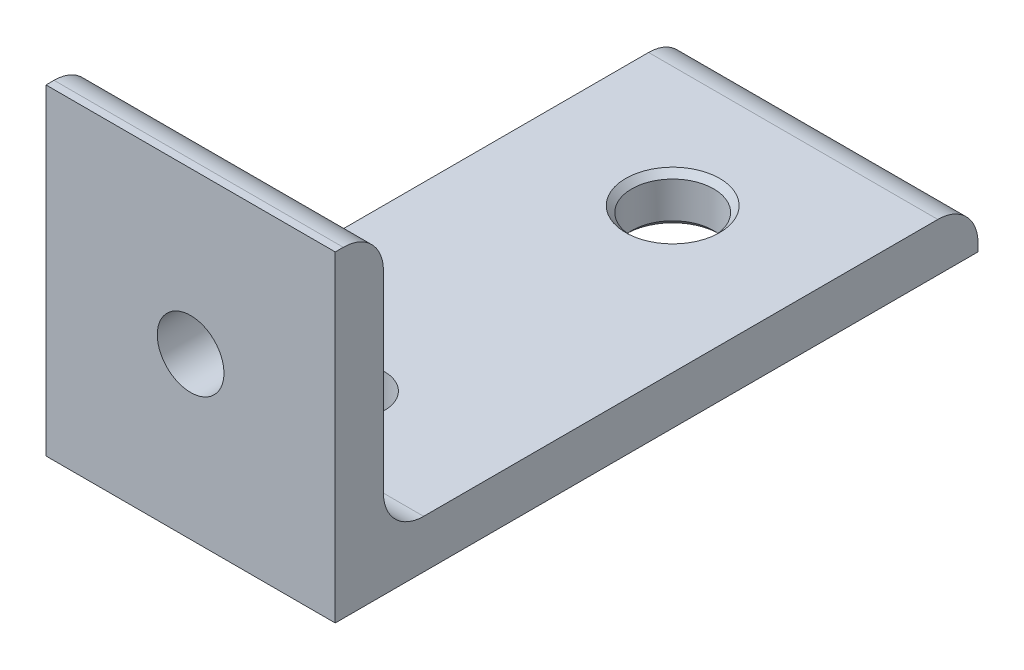
ISO-10303-21;
HEADER;
FILE_DESCRIPTION(('STEP AP214'),'2;1');
FILE_NAME('part.step','',(''),(''),'','','');
FILE_SCHEMA(('AUTOMOTIVE_DESIGN { 1 0 10303 214 1 1 1 1 }'));
ENDSEC;
DATA;
#1=APPLICATION_CONTEXT('core data for automotive mechanical design processes');
#2=APPLICATION_PROTOCOL_DEFINITION('international standard','automotive_design',2000,#1);
#3=PRODUCT_CONTEXT('',#1,'mechanical');
#4=PRODUCT('Part','Part','',(#3));
#5=PRODUCT_RELATED_PRODUCT_CATEGORY('part','',(#4));
#6=PRODUCT_DEFINITION_FORMATION('','',#4);
#7=PRODUCT_DEFINITION_CONTEXT('part definition',#1,'design');
#8=PRODUCT_DEFINITION('design','',#6,#7);
#9=PRODUCT_DEFINITION_SHAPE('','',#8);
#10=(LENGTH_UNIT() NAMED_UNIT(*) SI_UNIT(.MILLI.,.METRE.));
#11=(NAMED_UNIT(*) PLANE_ANGLE_UNIT() SI_UNIT($,.RADIAN.));
#12=(NAMED_UNIT(*) SI_UNIT($,.STERADIAN.) SOLID_ANGLE_UNIT());
#13=UNCERTAINTY_MEASURE_WITH_UNIT(LENGTH_MEASURE(1.E-05),#10,'distance_accuracy_value','');
#14=(GEOMETRIC_REPRESENTATION_CONTEXT(3) GLOBAL_UNCERTAINTY_ASSIGNED_CONTEXT((#13)) GLOBAL_UNIT_ASSIGNED_CONTEXT((#10,
#11,#12)) REPRESENTATION_CONTEXT('',''));
#15=CARTESIAN_POINT('',(0.,0.,0.));
#16=DIRECTION('',(0.,0.,1.));
#17=DIRECTION('',(1.,0.,0.));
#18=AXIS2_PLACEMENT_3D('',#15,#16,#17);
#19=CARTESIAN_POINT('',(18.,40.,0.));
#20=DIRECTION('',(0.,-1.,0.));
#21=DIRECTION('',(0.,0.,-1.));
#22=AXIS2_PLACEMENT_3D('',#19,#20,#21);
#23=PLANE('',#22);
#24=DIRECTION('',(0.,0.,1.));
#25=VECTOR('',#24,1.);
#26=CARTESIAN_POINT('',(18.,40.,0.));
#27=LINE('',#26,#25);
#28=CARTESIAN_POINT('',(18.,40.,-1.));
#29=VERTEX_POINT('',#28);
#30=CARTESIAN_POINT('',(18.,40.,0.));
#31=VERTEX_POINT('',#30);
#32=EDGE_CURVE('E111',#29,#31,#27,.T.);
#33=ORIENTED_EDGE('',*,*,#32,.F.);
#34=DIRECTION('',(-1.,0.,0.));
#35=VECTOR('',#34,1.);
#36=CARTESIAN_POINT('',(18.,40.,-1.));
#37=LINE('',#36,#35);
#38=CARTESIAN_POINT('',(-18.,40.,-1.));
#39=VERTEX_POINT('',#38);
#40=EDGE_CURVE('E152',#29,#39,#37,.T.);
#41=ORIENTED_EDGE('',*,*,#40,.T.);
#42=DIRECTION('',(0.,0.,1.));
#43=VECTOR('',#42,1.);
#44=CARTESIAN_POINT('',(-18.,40.,0.));
#45=LINE('',#44,#43);
#46=CARTESIAN_POINT('',(-18.,40.,0.));
#47=VERTEX_POINT('',#46);
#48=EDGE_CURVE('E135',#39,#47,#45,.T.);
#49=ORIENTED_EDGE('',*,*,#48,.T.);
#50=DIRECTION('',(-1.,0.,0.));
#51=VECTOR('',#50,1.);
#52=CARTESIAN_POINT('',(18.,40.,0.));
#53=LINE('',#52,#51);
#54=EDGE_CURVE('E128',#31,#47,#53,.T.);
#55=ORIENTED_EDGE('',*,*,#54,.F.);
#56=EDGE_LOOP('',(#33,#41,#49,#55));
#57=FACE_BOUND('',#56,.T.);
#58=ADVANCED_FACE('F39',(#57),#23,.F.);
#59=CARTESIAN_POINT('',(18.,40.,0.));
#60=DIRECTION('',(0.,0.,-1.));
#61=DIRECTION('',(-1.,0.,0.));
#62=AXIS2_PLACEMENT_3D('',#59,#60,#61);
#63=PLANE('',#62);
#64=CARTESIAN_POINT('',(0.,20.,0.));
#65=DIRECTION('',(0.,0.,-1.));
#66=DIRECTION('',(-1.,0.,0.));
#67=AXIS2_PLACEMENT_3D('',#64,#65,#66);
#68=CIRCLE('',#67,4.15);
#69=CARTESIAN_POINT('',(-4.15,20.,0.));
#70=VERTEX_POINT('',#69);
#71=EDGE_CURVE('E227',#70,#70,#68,.T.);
#72=ORIENTED_EDGE('',*,*,#71,.T.);
#73=EDGE_LOOP('',(#72));
#74=FACE_BOUND('',#73,.T.);
#75=DIRECTION('',(0.,-1.,0.));
#76=VECTOR('',#75,1.);
#77=CARTESIAN_POINT('',(-18.,40.,0.));
#78=LINE('',#77,#76);
#79=CARTESIAN_POINT('',(-18.,0.,0.));
#80=VERTEX_POINT('',#79);
#81=EDGE_CURVE('E196',#47,#80,#78,.T.);
#82=ORIENTED_EDGE('',*,*,#81,.T.);
#83=DIRECTION('',(-1.,0.,0.));
#84=VECTOR('',#83,1.);
#85=CARTESIAN_POINT('',(18.,0.,0.));
#86=LINE('',#85,#84);
#87=CARTESIAN_POINT('',(18.,0.,0.));
#88=VERTEX_POINT('',#87);
#89=EDGE_CURVE('E130',#88,#80,#86,.T.);
#90=ORIENTED_EDGE('',*,*,#89,.F.);
#91=DIRECTION('',(0.,-1.,0.));
#92=VECTOR('',#91,1.);
#93=CARTESIAN_POINT('',(18.,40.,0.));
#94=LINE('',#93,#92);
#95=EDGE_CURVE('E115',#31,#88,#94,.T.);
#96=ORIENTED_EDGE('',*,*,#95,.F.);
#97=ORIENTED_EDGE('',*,*,#54,.T.);
#98=EDGE_LOOP('',(#82,#90,#96,#97));
#99=FACE_BOUND('',#98,.T.);
#100=ADVANCED_FACE('F127',(#74,#99),#63,.F.);
#101=CARTESIAN_POINT('',(18.,0.,0.));
#102=DIRECTION('',(0.,1.,0.));
#103=DIRECTION('',(0.,0.,1.));
#104=AXIS2_PLACEMENT_3D('',#101,#102,#103);
#105=PLANE('',#104);
#106=CARTESIAN_POINT('',(0.,0.,-60.));
#107=DIRECTION('',(0.,1.,0.));
#108=DIRECTION('',(0.,0.,1.));
#109=AXIS2_PLACEMENT_3D('',#106,#107,#108);
#110=CIRCLE('',#109,5.85);
#111=CARTESIAN_POINT('',(0.,0.,-54.15));
#112=VERTEX_POINT('',#111);
#113=EDGE_CURVE('E165',#112,#112,#110,.T.);
#114=ORIENTED_EDGE('',*,*,#113,.T.);
#115=EDGE_LOOP('',(#114));
#116=FACE_BOUND('',#115,.T.);
#117=CARTESIAN_POINT('',(0.,0.,-20.));
#118=DIRECTION('',(0.,1.,0.));
#119=DIRECTION('',(0.,0.,1.));
#120=AXIS2_PLACEMENT_3D('',#117,#118,#119);
#121=CIRCLE('',#120,4.15);
#122=CARTESIAN_POINT('',(0.,0.,-15.85));
#123=VERTEX_POINT('',#122);
#124=EDGE_CURVE('E190',#123,#123,#121,.T.);
#125=ORIENTED_EDGE('',*,*,#124,.T.);
#126=EDGE_LOOP('',(#125));
#127=FACE_BOUND('',#126,.T.);
#128=DIRECTION('',(0.,0.,-1.));
#129=VECTOR('',#128,1.);
#130=CARTESIAN_POINT('',(-18.,0.,0.));
#131=LINE('',#130,#129);
#132=CARTESIAN_POINT('',(-18.,0.,-80.));
#133=VERTEX_POINT('',#132);
#134=EDGE_CURVE('E193',#80,#133,#131,.T.);
#135=ORIENTED_EDGE('',*,*,#134,.T.);
#136=DIRECTION('',(-1.,0.,0.));
#137=VECTOR('',#136,1.);
#138=CARTESIAN_POINT('',(18.,0.,-80.));
#139=LINE('',#138,#137);
#140=CARTESIAN_POINT('',(18.,0.,-80.));
#141=VERTEX_POINT('',#140);
#142=EDGE_CURVE('E141',#141,#133,#139,.T.);
#143=ORIENTED_EDGE('',*,*,#142,.F.);
#144=DIRECTION('',(0.,0.,-1.));
#145=VECTOR('',#144,1.);
#146=CARTESIAN_POINT('',(18.,0.,0.));
#147=LINE('',#146,#145);
#148=EDGE_CURVE('E132',#88,#141,#147,.T.);
#149=ORIENTED_EDGE('',*,*,#148,.F.);
#150=ORIENTED_EDGE('',*,*,#89,.T.);
#151=EDGE_LOOP('',(#135,#143,#149,#150));
#152=FACE_BOUND('',#151,.T.);
#153=ADVANCED_FACE('F182',(#116,#127,#152),#105,.F.);
#154=CARTESIAN_POINT('',(18.,6.,-80.));
#155=DIRECTION('',(0.,0.,1.));
#156=DIRECTION('',(1.,0.,0.));
#157=AXIS2_PLACEMENT_3D('',#154,#155,#156);
#158=PLANE('',#157);
#159=DIRECTION('',(0.,1.,0.));
#160=VECTOR('',#159,1.);
#161=CARTESIAN_POINT('',(-18.,6.,-80.));
#162=LINE('',#161,#160);
#163=CARTESIAN_POINT('',(-18.,1.,-80.));
#164=VERTEX_POINT('',#163);
#165=EDGE_CURVE('E195',#133,#164,#162,.T.);
#166=ORIENTED_EDGE('',*,*,#165,.T.);
#167=DIRECTION('',(-1.,0.,0.));
#168=VECTOR('',#167,1.);
#169=CARTESIAN_POINT('',(18.,1.,-80.));
#170=LINE('',#169,#168);
#171=CARTESIAN_POINT('',(18.,1.,-80.));
#172=VERTEX_POINT('',#171);
#173=EDGE_CURVE('E54',#164,#172,#170,.F.);
#174=ORIENTED_EDGE('',*,*,#173,.T.);
#175=DIRECTION('',(0.,1.,0.));
#176=VECTOR('',#175,1.);
#177=CARTESIAN_POINT('',(18.,6.,-80.));
#178=LINE('',#177,#176);
#179=EDGE_CURVE('E198',#141,#172,#178,.T.);
#180=ORIENTED_EDGE('',*,*,#179,.F.);
#181=ORIENTED_EDGE('',*,*,#142,.T.);
#182=EDGE_LOOP('',(#166,#174,#180,#181));
#183=FACE_BOUND('',#182,.T.);
#184=ADVANCED_FACE('F185',(#183),#158,.F.);
#185=CARTESIAN_POINT('',(18.,6.,-6.));
#186=DIRECTION('',(0.,-1.,0.));
#187=DIRECTION('',(0.,0.,-1.));
#188=AXIS2_PLACEMENT_3D('',#185,#186,#187);
#189=PLANE('',#188);
#190=CARTESIAN_POINT('',(0.,6.,-60.));
#191=DIRECTION('',(0.,-1.,0.));
#192=DIRECTION('',(0.,0.,-1.));
#193=AXIS2_PLACEMENT_3D('',#190,#191,#192);
#194=CIRCLE('',#193,5.85000000000001);
#195=CARTESIAN_POINT('',(0.,6.,-65.85));
#196=VERTEX_POINT('',#195);
#197=EDGE_CURVE('E11',#196,#196,#194,.T.);
#198=ORIENTED_EDGE('',*,*,#197,.T.);
#199=EDGE_LOOP('',(#198));
#200=FACE_BOUND('',#199,.T.);
#201=CARTESIAN_POINT('',(0.,6.,-20.));
#202=DIRECTION('',(0.,1.,0.));
#203=DIRECTION('',(0.,0.,1.));
#204=AXIS2_PLACEMENT_3D('',#201,#202,#203);
#205=CIRCLE('',#204,4.15);
#206=CARTESIAN_POINT('',(0.,6.,-15.85));
#207=VERTEX_POINT('',#206);
#208=EDGE_CURVE('E216',#207,#207,#205,.T.);
#209=ORIENTED_EDGE('',*,*,#208,.F.);
#210=EDGE_LOOP('',(#209));
#211=FACE_BOUND('',#210,.T.);
#212=DIRECTION('',(0.,0.,1.));
#213=VECTOR('',#212,1.);
#214=CARTESIAN_POINT('',(-18.,6.,-6.));
#215=LINE('',#214,#213);
#216=CARTESIAN_POINT('',(-18.,6.,-75.));
#217=VERTEX_POINT('',#216);
#218=CARTESIAN_POINT('',(-18.,6.,-11.));
#219=VERTEX_POINT('',#218);
#220=EDGE_CURVE('E201',#217,#219,#215,.T.);
#221=ORIENTED_EDGE('',*,*,#220,.T.);
#222=DIRECTION('',(-1.,0.,0.));
#223=VECTOR('',#222,1.);
#224=CARTESIAN_POINT('',(18.,6.,-11.));
#225=LINE('',#224,#223);
#226=CARTESIAN_POINT('',(18.,6.,-11.));
#227=VERTEX_POINT('',#226);
#228=EDGE_CURVE('E150',#219,#227,#225,.F.);
#229=ORIENTED_EDGE('',*,*,#228,.T.);
#230=DIRECTION('',(0.,0.,1.));
#231=VECTOR('',#230,1.);
#232=CARTESIAN_POINT('',(18.,6.,-6.));
#233=LINE('',#232,#231);
#234=CARTESIAN_POINT('',(18.,6.,-75.));
#235=VERTEX_POINT('',#234);
#236=EDGE_CURVE('E222',#235,#227,#233,.T.);
#237=ORIENTED_EDGE('',*,*,#236,.F.);
#238=DIRECTION('',(-1.,0.,0.));
#239=VECTOR('',#238,1.);
#240=CARTESIAN_POINT('',(18.,6.,-75.));
#241=LINE('',#240,#239);
#242=EDGE_CURVE('E147',#235,#217,#241,.T.);
#243=ORIENTED_EDGE('',*,*,#242,.T.);
#244=EDGE_LOOP('',(#221,#229,#237,#243));
#245=FACE_BOUND('',#244,.T.);
#246=ADVANCED_FACE('F244',(#200,#211,#245),#189,.F.);
#247=CARTESIAN_POINT('',(18.,40.,-6.));
#248=DIRECTION('',(0.,0.,1.));
#249=DIRECTION('',(1.,0.,0.));
#250=AXIS2_PLACEMENT_3D('',#247,#248,#249);
#251=PLANE('',#250);
#252=CARTESIAN_POINT('',(0.,20.,-6.));
#253=DIRECTION('',(0.,0.,-1.));
#254=DIRECTION('',(-1.,0.,0.));
#255=AXIS2_PLACEMENT_3D('',#252,#253,#254);
#256=CIRCLE('',#255,4.15);
#257=CARTESIAN_POINT('',(-4.15,20.,-6.));
#258=VERTEX_POINT('',#257);
#259=EDGE_CURVE('E229',#258,#258,#256,.T.);
#260=ORIENTED_EDGE('',*,*,#259,.F.);
#261=EDGE_LOOP('',(#260));
#262=FACE_BOUND('',#261,.T.);
#263=DIRECTION('',(0.,1.,0.));
#264=VECTOR('',#263,1.);
#265=CARTESIAN_POINT('',(18.,40.,-6.));
#266=LINE('',#265,#264);
#267=CARTESIAN_POINT('',(18.,11.,-6.));
#268=VERTEX_POINT('',#267);
#269=CARTESIAN_POINT('',(18.,35.,-6.));
#270=VERTEX_POINT('',#269);
#271=EDGE_CURVE('E199',#268,#270,#266,.T.);
#272=ORIENTED_EDGE('',*,*,#271,.F.);
#273=DIRECTION('',(-1.,0.,0.));
#274=VECTOR('',#273,1.);
#275=CARTESIAN_POINT('',(-18.,11.,-6.));
#276=LINE('',#275,#274);
#277=CARTESIAN_POINT('',(-18.,11.,-6.));
#278=VERTEX_POINT('',#277);
#279=EDGE_CURVE('E139',#268,#278,#276,.T.);
#280=ORIENTED_EDGE('',*,*,#279,.T.);
#281=DIRECTION('',(0.,1.,0.));
#282=VECTOR('',#281,1.);
#283=CARTESIAN_POINT('',(-18.,40.,-6.));
#284=LINE('',#283,#282);
#285=CARTESIAN_POINT('',(-18.,35.,-6.));
#286=VERTEX_POINT('',#285);
#287=EDGE_CURVE('E123',#278,#286,#284,.T.);
#288=ORIENTED_EDGE('',*,*,#287,.T.);
#289=DIRECTION('',(-1.,0.,0.));
#290=VECTOR('',#289,1.);
#291=CARTESIAN_POINT('',(18.,35.,-6.));
#292=LINE('',#291,#290);
#293=EDGE_CURVE('E137',#286,#270,#292,.F.);
#294=ORIENTED_EDGE('',*,*,#293,.T.);
#295=EDGE_LOOP('',(#272,#280,#288,#294));
#296=FACE_BOUND('',#295,.T.);
#297=ADVANCED_FACE('F212',(#262,#296),#251,.F.);
#298=CARTESIAN_POINT('',(18.,0.,0.));
#299=DIRECTION('',(-1.,0.,0.));
#300=DIRECTION('',(0.,0.,1.));
#301=AXIS2_PLACEMENT_3D('',#298,#299,#300);
#302=PLANE('',#301);
#303=ORIENTED_EDGE('',*,*,#271,.T.);
#304=CARTESIAN_POINT('',(18.,35.,-1.));
#305=DIRECTION('',(-1.,0.,0.));
#306=DIRECTION('',(0.,0.,1.));
#307=AXIS2_PLACEMENT_3D('',#304,#305,#306);
#308=CIRCLE('',#307,5.);
#309=EDGE_CURVE('E118',#270,#29,#308,.F.);
#310=ORIENTED_EDGE('',*,*,#309,.T.);
#311=ORIENTED_EDGE('',*,*,#32,.T.);
#312=ORIENTED_EDGE('',*,*,#95,.T.);
#313=ORIENTED_EDGE('',*,*,#148,.T.);
#314=ORIENTED_EDGE('',*,*,#179,.T.);
#315=CARTESIAN_POINT('',(18.,1.,-75.));
#316=DIRECTION('',(-1.,0.,0.));
#317=DIRECTION('',(0.,0.,1.));
#318=AXIS2_PLACEMENT_3D('',#315,#316,#317);
#319=CIRCLE('',#318,5.);
#320=EDGE_CURVE('E157',#172,#235,#319,.F.);
#321=ORIENTED_EDGE('',*,*,#320,.T.);
#322=ORIENTED_EDGE('',*,*,#236,.T.);
#323=CARTESIAN_POINT('',(18.,11.,-11.));
#324=DIRECTION('',(-1.,0.,0.));
#325=DIRECTION('',(0.,0.,1.));
#326=AXIS2_PLACEMENT_3D('',#323,#324,#325);
#327=CIRCLE('',#326,5.);
#328=EDGE_CURVE('E163',#227,#268,#327,.T.);
#329=ORIENTED_EDGE('',*,*,#328,.T.);
#330=EDGE_LOOP('',(#303,#310,#311,#312,#313,#314,#321,#322,#329));
#331=FACE_BOUND('',#330,.T.);
#332=ADVANCED_FACE('F114',(#331),#302,.F.);
#333=CARTESIAN_POINT('',(-18.,0.,0.));
#334=DIRECTION('',(-1.,0.,0.));
#335=DIRECTION('',(0.,0.,1.));
#336=AXIS2_PLACEMENT_3D('',#333,#334,#335);
#337=PLANE('',#336);
#338=ORIENTED_EDGE('',*,*,#48,.F.);
#339=CARTESIAN_POINT('',(-18.,35.,-1.));
#340=DIRECTION('',(-1.,0.,0.));
#341=DIRECTION('',(0.,0.,1.));
#342=AXIS2_PLACEMENT_3D('',#339,#340,#341);
#343=CIRCLE('',#342,5.);
#344=EDGE_CURVE('E155',#39,#286,#343,.T.);
#345=ORIENTED_EDGE('',*,*,#344,.T.);
#346=ORIENTED_EDGE('',*,*,#287,.F.);
#347=CARTESIAN_POINT('',(-18.,11.,-11.));
#348=DIRECTION('',(-1.,0.,0.));
#349=DIRECTION('',(0.,0.,1.));
#350=AXIS2_PLACEMENT_3D('',#347,#348,#349);
#351=CIRCLE('',#350,5.);
#352=EDGE_CURVE('E161',#278,#219,#351,.F.);
#353=ORIENTED_EDGE('',*,*,#352,.T.);
#354=ORIENTED_EDGE('',*,*,#220,.F.);
#355=CARTESIAN_POINT('',(-18.,1.,-75.));
#356=DIRECTION('',(-1.,0.,0.));
#357=DIRECTION('',(0.,0.,1.));
#358=AXIS2_PLACEMENT_3D('',#355,#356,#357);
#359=CIRCLE('',#358,5.);
#360=EDGE_CURVE('E62',#217,#164,#359,.T.);
#361=ORIENTED_EDGE('',*,*,#360,.T.);
#362=ORIENTED_EDGE('',*,*,#165,.F.);
#363=ORIENTED_EDGE('',*,*,#134,.F.);
#364=ORIENTED_EDGE('',*,*,#81,.F.);
#365=EDGE_LOOP('',(#338,#345,#346,#353,#354,#361,#362,#363,#364));
#366=FACE_BOUND('',#365,.T.);
#367=ADVANCED_FACE('F200',(#366),#337,.T.);
#368=CARTESIAN_POINT('',(0.,0.,-20.));
#369=DIRECTION('',(0.,1.,0.));
#370=DIRECTION('',(0.,0.,1.));
#371=AXIS2_PLACEMENT_3D('',#368,#369,#370);
#372=CYLINDRICAL_SURFACE('',#371,4.15);
#373=ORIENTED_EDGE('',*,*,#124,.F.);
#374=EDGE_LOOP('',(#373));
#375=FACE_BOUND('',#374,.T.);
#376=ORIENTED_EDGE('',*,*,#208,.T.);
#377=EDGE_LOOP('',(#376));
#378=FACE_BOUND('',#377,.T.);
#379=ADVANCED_FACE('F295',(#375,#378),#372,.F.);
#380=CARTESIAN_POINT('',(0.,0.,-60.));
#381=DIRECTION('',(0.,1.,0.));
#382=DIRECTION('',(0.,0.,1.));
#383=AXIS2_PLACEMENT_3D('',#380,#381,#382);
#384=CYLINDRICAL_SURFACE('',#383,5.1);
#385=CARTESIAN_POINT('',(0.,0.75000000000001,-60.));
#386=DIRECTION('',(0.,1.,0.));
#387=DIRECTION('',(0.,0.,1.));
#388=AXIS2_PLACEMENT_3D('',#385,#386,#387);
#389=CIRCLE('',#388,5.1);
#390=CARTESIAN_POINT('',(0.,0.75000000000001,-54.9));
#391=VERTEX_POINT('',#390);
#392=EDGE_CURVE('E47',#391,#391,#389,.F.);
#393=ORIENTED_EDGE('',*,*,#392,.T.);
#394=EDGE_LOOP('',(#393));
#395=FACE_BOUND('',#394,.T.);
#396=CARTESIAN_POINT('',(0.,5.24999999999998,-60.));
#397=DIRECTION('',(0.,-1.,0.));
#398=DIRECTION('',(0.,0.,-1.));
#399=AXIS2_PLACEMENT_3D('',#396,#397,#398);
#400=CIRCLE('',#399,5.1);
#401=CARTESIAN_POINT('',(0.,5.24999999999998,-65.1));
#402=VERTEX_POINT('',#401);
#403=EDGE_CURVE('E168',#402,#402,#400,.F.);
#404=ORIENTED_EDGE('',*,*,#403,.T.);
#405=EDGE_LOOP('',(#404));
#406=FACE_BOUND('',#405,.T.);
#407=ADVANCED_FACE('F173',(#395,#406),#384,.F.);
#408=CARTESIAN_POINT('',(0.,20.,0.));
#409=DIRECTION('',(0.,0.,-1.));
#410=DIRECTION('',(-1.,0.,0.));
#411=AXIS2_PLACEMENT_3D('',#408,#409,#410);
#412=CYLINDRICAL_SURFACE('',#411,4.15);
#413=ORIENTED_EDGE('',*,*,#71,.F.);
#414=EDGE_LOOP('',(#413));
#415=FACE_BOUND('',#414,.T.);
#416=ORIENTED_EDGE('',*,*,#259,.T.);
#417=EDGE_LOOP('',(#416));
#418=FACE_BOUND('',#417,.T.);
#419=ADVANCED_FACE('F236',(#415,#418),#412,.F.);
#420=CARTESIAN_POINT('',(18.,11.,-11.));
#421=DIRECTION('',(1.,0.,0.));
#422=DIRECTION('',(0.,0.,-1.));
#423=AXIS2_PLACEMENT_3D('',#420,#421,#422);
#424=CYLINDRICAL_SURFACE('',#423,5.);
#425=ORIENTED_EDGE('',*,*,#328,.F.);
#426=ORIENTED_EDGE('',*,*,#228,.F.);
#427=ORIENTED_EDGE('',*,*,#352,.F.);
#428=ORIENTED_EDGE('',*,*,#279,.F.);
#429=EDGE_LOOP('',(#425,#426,#427,#428));
#430=FACE_BOUND('',#429,.T.);
#431=ADVANCED_FACE('F239',(#430),#424,.F.);
#432=CARTESIAN_POINT('',(18.,35.,-1.));
#433=DIRECTION('',(-1.,0.,0.));
#434=DIRECTION('',(0.,0.,1.));
#435=AXIS2_PLACEMENT_3D('',#432,#433,#434);
#436=CYLINDRICAL_SURFACE('',#435,5.);
#437=ORIENTED_EDGE('',*,*,#309,.F.);
#438=ORIENTED_EDGE('',*,*,#293,.F.);
#439=ORIENTED_EDGE('',*,*,#344,.F.);
#440=ORIENTED_EDGE('',*,*,#40,.F.);
#441=EDGE_LOOP('',(#437,#438,#439,#440));
#442=FACE_BOUND('',#441,.T.);
#443=ADVANCED_FACE('F215',(#442),#436,.T.);
#444=CARTESIAN_POINT('',(18.,1.,-75.));
#445=DIRECTION('',(-1.,0.,0.));
#446=DIRECTION('',(0.,0.,1.));
#447=AXIS2_PLACEMENT_3D('',#444,#445,#446);
#448=CYLINDRICAL_SURFACE('',#447,5.);
#449=ORIENTED_EDGE('',*,*,#320,.F.);
#450=ORIENTED_EDGE('',*,*,#173,.F.);
#451=ORIENTED_EDGE('',*,*,#360,.F.);
#452=ORIENTED_EDGE('',*,*,#242,.F.);
#453=EDGE_LOOP('',(#449,#450,#451,#452));
#454=FACE_BOUND('',#453,.T.);
#455=ADVANCED_FACE('F179',(#454),#448,.T.);
#456=CARTESIAN_POINT('',(0.,0.,-60.));
#457=DIRECTION('',(0.,-1.,0.));
#458=DIRECTION('',(0.,0.,-1.));
#459=AXIS2_PLACEMENT_3D('',#456,#457,#458);
#460=CONICAL_SURFACE('',#459,5.85,0.785398163397441);
#461=ORIENTED_EDGE('',*,*,#392,.F.);
#462=EDGE_LOOP('',(#461));
#463=FACE_BOUND('',#462,.T.);
#464=ORIENTED_EDGE('',*,*,#113,.F.);
#465=EDGE_LOOP('',(#464));
#466=FACE_BOUND('',#465,.T.);
#467=ADVANCED_FACE('F176',(#463,#466),#460,.F.);
#468=CARTESIAN_POINT('',(0.,5.24999999999998,-60.));
#469=DIRECTION('',(0.,1.,0.));
#470=DIRECTION('',(0.,0.,1.));
#471=AXIS2_PLACEMENT_3D('',#468,#469,#470);
#472=CONICAL_SURFACE('',#471,5.1,0.785398163397441);
#473=ORIENTED_EDGE('',*,*,#197,.F.);
#474=EDGE_LOOP('',(#473));
#475=FACE_BOUND('',#474,.T.);
#476=ORIENTED_EDGE('',*,*,#403,.F.);
#477=EDGE_LOOP('',(#476));
#478=FACE_BOUND('',#477,.T.);
#479=ADVANCED_FACE('F41',(#475,#478),#472,.F.);
#480=CLOSED_SHELL('',(#58,#100,#153,#184,#246,#297,#332,#367,#379,#407,#419,#431,#443,#455,#467,#479));
#481=MANIFOLD_SOLID_BREP('B2',#480);
#482=ADVANCED_BREP_SHAPE_REPRESENTATION('',(#18,#481),#14);
#483=SHAPE_DEFINITION_REPRESENTATION(#9,#482);
ENDSEC;
END-ISO-10303-21;
